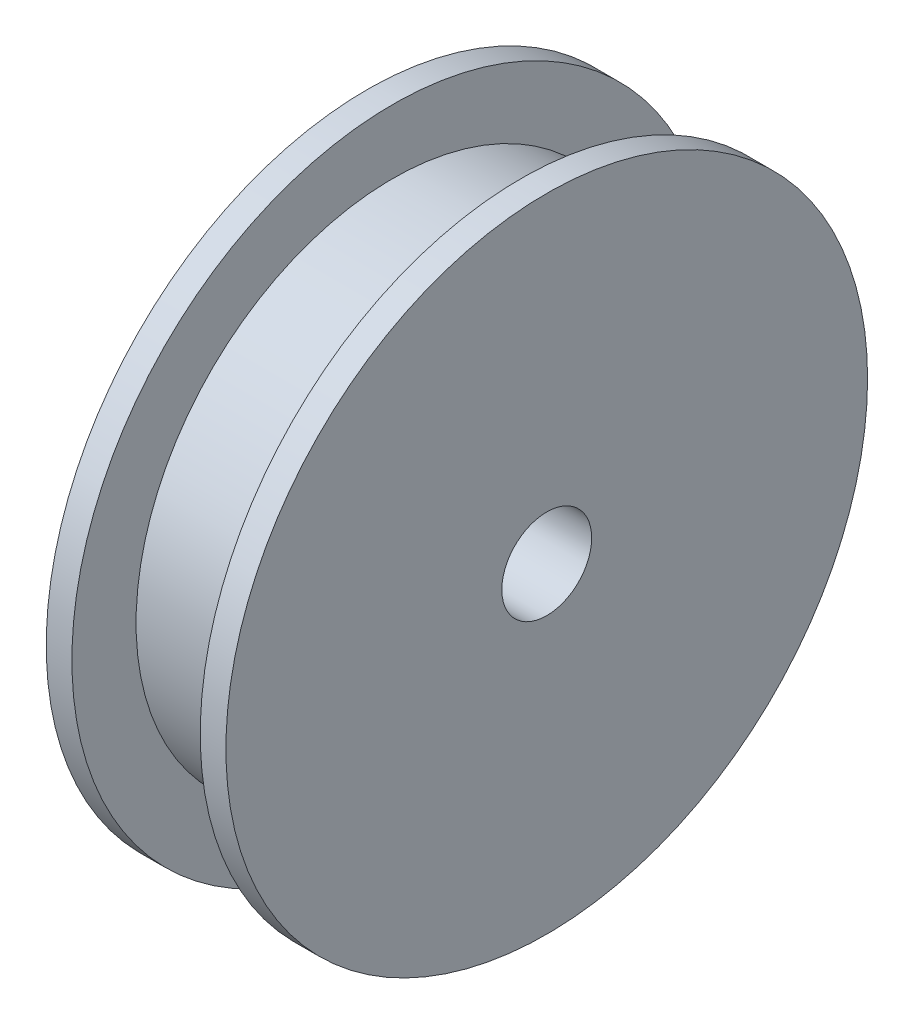
ISO-10303-21;
HEADER;
FILE_DESCRIPTION(('STEP AP214'),'2;1');
FILE_NAME('part.step','',(''),(''),'','','');
FILE_SCHEMA(('AUTOMOTIVE_DESIGN { 1 0 10303 214 1 1 1 1 }'));
ENDSEC;
DATA;
#1=APPLICATION_CONTEXT('core data for automotive mechanical design processes');
#2=APPLICATION_PROTOCOL_DEFINITION('international standard','automotive_design',2000,#1);
#3=PRODUCT_CONTEXT('',#1,'mechanical');
#4=PRODUCT('Part','Part','',(#3));
#5=PRODUCT_RELATED_PRODUCT_CATEGORY('part','',(#4));
#6=PRODUCT_DEFINITION_FORMATION('','',#4);
#7=PRODUCT_DEFINITION_CONTEXT('part definition',#1,'design');
#8=PRODUCT_DEFINITION('design','',#6,#7);
#9=PRODUCT_DEFINITION_SHAPE('','',#8);
#10=(LENGTH_UNIT() NAMED_UNIT(*) SI_UNIT(.MILLI.,.METRE.));
#11=(NAMED_UNIT(*) PLANE_ANGLE_UNIT() SI_UNIT($,.RADIAN.));
#12=(NAMED_UNIT(*) SI_UNIT($,.STERADIAN.) SOLID_ANGLE_UNIT());
#13=UNCERTAINTY_MEASURE_WITH_UNIT(LENGTH_MEASURE(1.E-05),#10,'distance_accuracy_value','');
#14=(GEOMETRIC_REPRESENTATION_CONTEXT(3) GLOBAL_UNCERTAINTY_ASSIGNED_CONTEXT((#13)) GLOBAL_UNIT_ASSIGNED_CONTEXT((#10,
#11,#12)) REPRESENTATION_CONTEXT('',''));
#15=CARTESIAN_POINT('',(0.,0.,0.));
#16=DIRECTION('',(0.,0.,1.));
#17=DIRECTION('',(1.,0.,0.));
#18=AXIS2_PLACEMENT_3D('',#15,#16,#17);
#19=CARTESIAN_POINT('',(2.,0.,0.));
#20=DIRECTION('',(-1.,0.,0.));
#21=DIRECTION('',(0.,0.,1.));
#22=AXIS2_PLACEMENT_3D('',#19,#20,#21);
#23=CYLINDRICAL_SURFACE('',#22,25.);
#24=CARTESIAN_POINT('',(2.,0.,0.));
#25=DIRECTION('',(1.,0.,0.));
#26=DIRECTION('',(0.,0.,-1.));
#27=AXIS2_PLACEMENT_3D('',#24,#25,#26);
#28=CIRCLE('',#27,25.);
#29=CARTESIAN_POINT('',(2.,0.,-25.));
#30=VERTEX_POINT('',#29);
#31=EDGE_CURVE('E38',#30,#30,#28,.T.);
#32=ORIENTED_EDGE('',*,*,#31,.F.);
#33=EDGE_LOOP('',(#32));
#34=FACE_BOUND('',#33,.T.);
#35=CARTESIAN_POINT('',(0.,0.,0.));
#36=DIRECTION('',(1.,0.,0.));
#37=DIRECTION('',(0.,0.,-1.));
#38=AXIS2_PLACEMENT_3D('',#35,#36,#37);
#39=CIRCLE('',#38,25.);
#40=CARTESIAN_POINT('',(0.,0.,-25.));
#41=VERTEX_POINT('',#40);
#42=EDGE_CURVE('E43',#41,#41,#39,.T.);
#43=ORIENTED_EDGE('',*,*,#42,.T.);
#44=EDGE_LOOP('',(#43));
#45=FACE_BOUND('',#44,.T.);
#46=ADVANCED_FACE('F31',(#34,#45),#23,.T.);
#47=CARTESIAN_POINT('',(2.,0.,0.));
#48=DIRECTION('',(1.,0.,0.));
#49=DIRECTION('',(0.,0.,-1.));
#50=AXIS2_PLACEMENT_3D('',#47,#48,#49);
#51=PLANE('',#50);
#52=CARTESIAN_POINT('',(2.,0.,0.));
#53=DIRECTION('',(1.,0.,0.));
#54=DIRECTION('',(0.,0.,-1.));
#55=AXIS2_PLACEMENT_3D('',#52,#53,#54);
#56=CIRCLE('',#55,20.);
#57=CARTESIAN_POINT('',(2.,0.,-20.));
#58=VERTEX_POINT('',#57);
#59=EDGE_CURVE('E10',#58,#58,#56,.T.);
#60=ORIENTED_EDGE('',*,*,#59,.F.);
#61=EDGE_LOOP('',(#60));
#62=FACE_BOUND('',#61,.T.);
#63=ORIENTED_EDGE('',*,*,#31,.T.);
#64=EDGE_LOOP('',(#63));
#65=FACE_BOUND('',#64,.T.);
#66=ADVANCED_FACE('F86',(#62,#65),#51,.T.);
#67=CARTESIAN_POINT('',(0.,0.,0.));
#68=DIRECTION('',(1.,0.,0.));
#69=DIRECTION('',(0.,0.,-1.));
#70=AXIS2_PLACEMENT_3D('',#67,#68,#69);
#71=PLANE('',#70);
#72=CARTESIAN_POINT('',(0.,0.,0.));
#73=DIRECTION('',(-1.,0.,0.));
#74=DIRECTION('',(0.,0.,1.));
#75=AXIS2_PLACEMENT_3D('',#72,#73,#74);
#76=CIRCLE('',#75,3.5);
#77=CARTESIAN_POINT('',(0.,0.,3.5));
#78=VERTEX_POINT('',#77);
#79=EDGE_CURVE('E62',#78,#78,#76,.T.);
#80=ORIENTED_EDGE('',*,*,#79,.F.);
#81=EDGE_LOOP('',(#80));
#82=FACE_BOUND('',#81,.T.);
#83=ORIENTED_EDGE('',*,*,#42,.F.);
#84=EDGE_LOOP('',(#83));
#85=FACE_BOUND('',#84,.T.);
#86=ADVANCED_FACE('F91',(#82,#85),#71,.F.);
#87=CARTESIAN_POINT('',(12.,0.,0.));
#88=DIRECTION('',(-1.,0.,0.));
#89=DIRECTION('',(0.,0.,1.));
#90=AXIS2_PLACEMENT_3D('',#87,#88,#89);
#91=CYLINDRICAL_SURFACE('',#90,20.);
#92=CARTESIAN_POINT('',(12.,0.,0.));
#93=DIRECTION('',(1.,0.,0.));
#94=DIRECTION('',(0.,0.,-1.));
#95=AXIS2_PLACEMENT_3D('',#92,#93,#94);
#96=CIRCLE('',#95,20.);
#97=CARTESIAN_POINT('',(12.,0.,-20.));
#98=VERTEX_POINT('',#97);
#99=EDGE_CURVE('E46',#98,#98,#96,.T.);
#100=ORIENTED_EDGE('',*,*,#99,.F.);
#101=EDGE_LOOP('',(#100));
#102=FACE_BOUND('',#101,.T.);
#103=ORIENTED_EDGE('',*,*,#59,.T.);
#104=EDGE_LOOP('',(#103));
#105=FACE_BOUND('',#104,.T.);
#106=ADVANCED_FACE('F81',(#102,#105),#91,.T.);
#107=CARTESIAN_POINT('',(14.,0.,0.));
#108=DIRECTION('',(-1.,0.,0.));
#109=DIRECTION('',(0.,0.,1.));
#110=AXIS2_PLACEMENT_3D('',#107,#108,#109);
#111=CYLINDRICAL_SURFACE('',#110,25.);
#112=CARTESIAN_POINT('',(14.,0.,0.));
#113=DIRECTION('',(1.,0.,0.));
#114=DIRECTION('',(0.,0.,-1.));
#115=AXIS2_PLACEMENT_3D('',#112,#113,#114);
#116=CIRCLE('',#115,25.);
#117=CARTESIAN_POINT('',(14.,0.,-25.));
#118=VERTEX_POINT('',#117);
#119=EDGE_CURVE('E52',#118,#118,#116,.T.);
#120=ORIENTED_EDGE('',*,*,#119,.F.);
#121=EDGE_LOOP('',(#120));
#122=FACE_BOUND('',#121,.T.);
#123=CARTESIAN_POINT('',(12.,0.,0.));
#124=DIRECTION('',(1.,0.,0.));
#125=DIRECTION('',(0.,0.,-1.));
#126=AXIS2_PLACEMENT_3D('',#123,#124,#125);
#127=CIRCLE('',#126,25.);
#128=CARTESIAN_POINT('',(12.,0.,-25.));
#129=VERTEX_POINT('',#128);
#130=EDGE_CURVE('E56',#129,#129,#127,.T.);
#131=ORIENTED_EDGE('',*,*,#130,.T.);
#132=EDGE_LOOP('',(#131));
#133=FACE_BOUND('',#132,.T.);
#134=ADVANCED_FACE('F74',(#122,#133),#111,.T.);
#135=CARTESIAN_POINT('',(14.,0.,0.));
#136=DIRECTION('',(1.,0.,0.));
#137=DIRECTION('',(0.,0.,-1.));
#138=AXIS2_PLACEMENT_3D('',#135,#136,#137);
#139=PLANE('',#138);
#140=CARTESIAN_POINT('',(14.,0.,0.));
#141=DIRECTION('',(1.,0.,0.));
#142=DIRECTION('',(0.,0.,-1.));
#143=AXIS2_PLACEMENT_3D('',#140,#141,#142);
#144=CIRCLE('',#143,3.5);
#145=CARTESIAN_POINT('',(14.,0.,-3.5));
#146=VERTEX_POINT('',#145);
#147=EDGE_CURVE('E34',#146,#146,#144,.T.);
#148=ORIENTED_EDGE('',*,*,#147,.F.);
#149=EDGE_LOOP('',(#148));
#150=FACE_BOUND('',#149,.T.);
#151=ORIENTED_EDGE('',*,*,#119,.T.);
#152=EDGE_LOOP('',(#151));
#153=FACE_BOUND('',#152,.T.);
#154=ADVANCED_FACE('F71',(#150,#153),#139,.T.);
#155=CARTESIAN_POINT('',(12.,0.,0.));
#156=DIRECTION('',(1.,0.,0.));
#157=DIRECTION('',(0.,0.,-1.));
#158=AXIS2_PLACEMENT_3D('',#155,#156,#157);
#159=PLANE('',#158);
#160=ORIENTED_EDGE('',*,*,#99,.T.);
#161=EDGE_LOOP('',(#160));
#162=FACE_BOUND('',#161,.T.);
#163=ORIENTED_EDGE('',*,*,#130,.F.);
#164=EDGE_LOOP('',(#163));
#165=FACE_BOUND('',#164,.T.);
#166=ADVANCED_FACE('F73',(#162,#165),#159,.F.);
#167=CARTESIAN_POINT('',(19.,0.,0.));
#168=DIRECTION('',(-1.,0.,0.));
#169=DIRECTION('',(0.,0.,1.));
#170=AXIS2_PLACEMENT_3D('',#167,#168,#169);
#171=CYLINDRICAL_SURFACE('',#170,3.5);
#172=ORIENTED_EDGE('',*,*,#147,.T.);
#173=EDGE_LOOP('',(#172));
#174=FACE_BOUND('',#173,.T.);
#175=ORIENTED_EDGE('',*,*,#79,.T.);
#176=EDGE_LOOP('',(#175));
#177=FACE_BOUND('',#176,.T.);
#178=ADVANCED_FACE('F69',(#174,#177),#171,.F.);
#179=CLOSED_SHELL('',(#46,#66,#86,#106,#134,#154,#166,#178));
#180=MANIFOLD_SOLID_BREP('B2',#179);
#181=ADVANCED_BREP_SHAPE_REPRESENTATION('',(#18,#180),#14);
#182=SHAPE_DEFINITION_REPRESENTATION(#9,#181);
ENDSEC;
END-ISO-10303-21;
